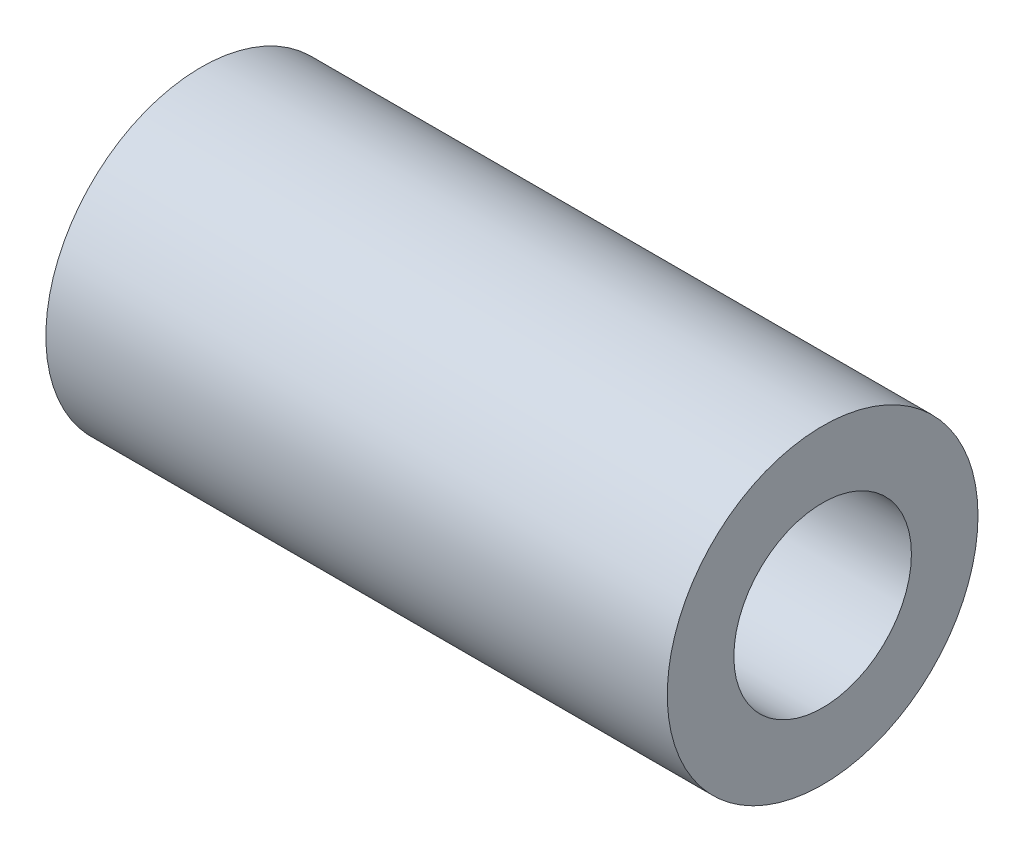
ISO-10303-21;
HEADER;
FILE_DESCRIPTION(('STEP AP214'),'2;1');
FILE_NAME('part.step','',(''),(''),'','','');
FILE_SCHEMA(('AUTOMOTIVE_DESIGN { 1 0 10303 214 1 1 1 1 }'));
ENDSEC;
DATA;
#1=APPLICATION_CONTEXT('core data for automotive mechanical design processes');
#2=APPLICATION_PROTOCOL_DEFINITION('international standard','automotive_design',2000,#1);
#3=PRODUCT_CONTEXT('',#1,'mechanical');
#4=PRODUCT('Part','Part','',(#3));
#5=PRODUCT_RELATED_PRODUCT_CATEGORY('part','',(#4));
#6=PRODUCT_DEFINITION_FORMATION('','',#4);
#7=PRODUCT_DEFINITION_CONTEXT('part definition',#1,'design');
#8=PRODUCT_DEFINITION('design','',#6,#7);
#9=PRODUCT_DEFINITION_SHAPE('','',#8);
#10=(LENGTH_UNIT() NAMED_UNIT(*) SI_UNIT(.MILLI.,.METRE.));
#11=(NAMED_UNIT(*) PLANE_ANGLE_UNIT() SI_UNIT($,.RADIAN.));
#12=(NAMED_UNIT(*) SI_UNIT($,.STERADIAN.) SOLID_ANGLE_UNIT());
#13=UNCERTAINTY_MEASURE_WITH_UNIT(LENGTH_MEASURE(1.E-05),#10,'distance_accuracy_value','');
#14=(GEOMETRIC_REPRESENTATION_CONTEXT(3) GLOBAL_UNCERTAINTY_ASSIGNED_CONTEXT((#13)) GLOBAL_UNIT_ASSIGNED_CONTEXT((#10,
#11,#12)) REPRESENTATION_CONTEXT('',''));
#15=CARTESIAN_POINT('',(0.,0.,0.));
#16=DIRECTION('',(0.,0.,1.));
#17=DIRECTION('',(1.,0.,0.));
#18=AXIS2_PLACEMENT_3D('',#15,#16,#17);
#19=CARTESIAN_POINT('',(14.,0.,0.));
#20=DIRECTION('',(1.,0.,0.));
#21=DIRECTION('',(0.,0.,-1.));
#22=AXIS2_PLACEMENT_3D('',#19,#20,#21);
#23=PLANE('',#22);
#24=CARTESIAN_POINT('',(14.,0.,0.));
#25=DIRECTION('',(1.,0.,0.));
#26=DIRECTION('',(0.,0.,-1.));
#27=AXIS2_PLACEMENT_3D('',#24,#25,#26);
#28=CIRCLE('',#27,7.);
#29=CARTESIAN_POINT('',(14.,0.,-7.));
#30=VERTEX_POINT('',#29);
#31=EDGE_CURVE('E10',#30,#30,#28,.T.);
#32=ORIENTED_EDGE('',*,*,#31,.T.);
#33=EDGE_LOOP('',(#32));
#34=FACE_BOUND('',#33,.T.);
#35=CARTESIAN_POINT('',(14.,0.,0.));
#36=DIRECTION('',(1.,0.,0.));
#37=DIRECTION('',(0.,0.,-1.));
#38=AXIS2_PLACEMENT_3D('',#35,#36,#37);
#39=CIRCLE('',#38,4.);
#40=CARTESIAN_POINT('',(14.,0.,-4.));
#41=VERTEX_POINT('',#40);
#42=EDGE_CURVE('E42',#41,#41,#39,.T.);
#43=ORIENTED_EDGE('',*,*,#42,.F.);
#44=EDGE_LOOP('',(#43));
#45=FACE_BOUND('',#44,.T.);
#46=ADVANCED_FACE('F31',(#34,#45),#23,.T.);
#47=CARTESIAN_POINT('',(-14.,0.,0.));
#48=DIRECTION('',(1.,0.,0.));
#49=DIRECTION('',(0.,0.,-1.));
#50=AXIS2_PLACEMENT_3D('',#47,#48,#49);
#51=PLANE('',#50);
#52=CARTESIAN_POINT('',(-14.,0.,0.));
#53=DIRECTION('',(1.,0.,0.));
#54=DIRECTION('',(0.,0.,-1.));
#55=AXIS2_PLACEMENT_3D('',#52,#53,#54);
#56=CIRCLE('',#55,7.);
#57=CARTESIAN_POINT('',(-14.,0.,-7.));
#58=VERTEX_POINT('',#57);
#59=EDGE_CURVE('E35',#58,#58,#56,.T.);
#60=ORIENTED_EDGE('',*,*,#59,.F.);
#61=EDGE_LOOP('',(#60));
#62=FACE_BOUND('',#61,.T.);
#63=CARTESIAN_POINT('',(-14.,0.,0.));
#64=DIRECTION('',(1.,0.,0.));
#65=DIRECTION('',(0.,0.,-1.));
#66=AXIS2_PLACEMENT_3D('',#63,#64,#65);
#67=CIRCLE('',#66,4.);
#68=CARTESIAN_POINT('',(-14.,0.,-4.));
#69=VERTEX_POINT('',#68);
#70=EDGE_CURVE('E44',#69,#69,#67,.T.);
#71=ORIENTED_EDGE('',*,*,#70,.T.);
#72=EDGE_LOOP('',(#71));
#73=FACE_BOUND('',#72,.T.);
#74=ADVANCED_FACE('F54',(#62,#73),#51,.F.);
#75=CARTESIAN_POINT('',(14.,0.,0.));
#76=DIRECTION('',(-1.,0.,0.));
#77=DIRECTION('',(0.,0.,1.));
#78=AXIS2_PLACEMENT_3D('',#75,#76,#77);
#79=CYLINDRICAL_SURFACE('',#78,7.);
#80=ORIENTED_EDGE('',*,*,#31,.F.);
#81=EDGE_LOOP('',(#80));
#82=FACE_BOUND('',#81,.T.);
#83=ORIENTED_EDGE('',*,*,#59,.T.);
#84=EDGE_LOOP('',(#83));
#85=FACE_BOUND('',#84,.T.);
#86=ADVANCED_FACE('F33',(#82,#85),#79,.T.);
#87=CARTESIAN_POINT('',(14.,0.,0.));
#88=DIRECTION('',(-1.,0.,0.));
#89=DIRECTION('',(0.,0.,1.));
#90=AXIS2_PLACEMENT_3D('',#87,#88,#89);
#91=CYLINDRICAL_SURFACE('',#90,4.);
#92=ORIENTED_EDGE('',*,*,#42,.T.);
#93=EDGE_LOOP('',(#92));
#94=FACE_BOUND('',#93,.T.);
#95=ORIENTED_EDGE('',*,*,#70,.F.);
#96=EDGE_LOOP('',(#95));
#97=FACE_BOUND('',#96,.T.);
#98=ADVANCED_FACE('F50',(#94,#97),#91,.F.);
#99=CLOSED_SHELL('',(#46,#74,#86,#98));
#100=MANIFOLD_SOLID_BREP('B2',#99);
#101=ADVANCED_BREP_SHAPE_REPRESENTATION('',(#18,#100),#14);
#102=SHAPE_DEFINITION_REPRESENTATION(#9,#101);
ENDSEC;
END-ISO-10303-21;
